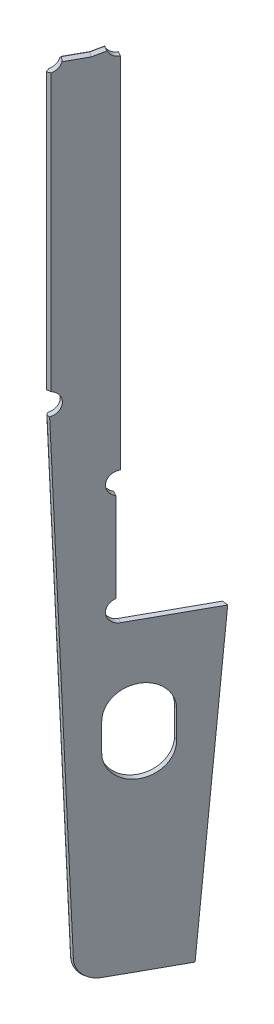
ISO-10303-21;
HEADER;
FILE_DESCRIPTION(('STEP AP214'),'2;1');
FILE_NAME('part.step','',(''),(''),'','','');
FILE_SCHEMA(('AUTOMOTIVE_DESIGN { 1 0 10303 214 1 1 1 1 }'));
ENDSEC;
DATA;
#1=APPLICATION_CONTEXT('core data for automotive mechanical design processes');
#2=APPLICATION_PROTOCOL_DEFINITION('international standard','automotive_design',2000,#1);
#3=PRODUCT_CONTEXT('',#1,'mechanical');
#4=PRODUCT('Part','Part','',(#3));
#5=PRODUCT_RELATED_PRODUCT_CATEGORY('part','',(#4));
#6=PRODUCT_DEFINITION_FORMATION('','',#4);
#7=PRODUCT_DEFINITION_CONTEXT('part definition',#1,'design');
#8=PRODUCT_DEFINITION('design','',#6,#7);
#9=PRODUCT_DEFINITION_SHAPE('','',#8);
#10=(LENGTH_UNIT() NAMED_UNIT(*) SI_UNIT(.MILLI.,.METRE.));
#11=(NAMED_UNIT(*) PLANE_ANGLE_UNIT() SI_UNIT($,.RADIAN.));
#12=(NAMED_UNIT(*) SI_UNIT($,.STERADIAN.) SOLID_ANGLE_UNIT());
#13=UNCERTAINTY_MEASURE_WITH_UNIT(LENGTH_MEASURE(1.E-05),#10,'distance_accuracy_value','');
#14=(GEOMETRIC_REPRESENTATION_CONTEXT(3) GLOBAL_UNCERTAINTY_ASSIGNED_CONTEXT((#13)) GLOBAL_UNIT_ASSIGNED_CONTEXT((#10,
#11,#12)) REPRESENTATION_CONTEXT('',''));
#15=CARTESIAN_POINT('',(0.,0.,0.));
#16=DIRECTION('',(0.,0.,1.));
#17=DIRECTION('',(1.,0.,0.));
#18=AXIS2_PLACEMENT_3D('',#15,#16,#17);
#19=CARTESIAN_POINT('',(498.305793985389,14720.,-981.474062663175));
#20=DIRECTION('',(0.874619707139395,0.,0.484809620246338));
#21=DIRECTION('',(0.484809620246338,0.,-0.874619707139395));
#22=AXIS2_PLACEMENT_3D('',#19,#20,#21);
#23=CYLINDRICAL_SURFACE('',#22,79.9999999999999);
#24=CARTESIAN_POINT('',(533.290582270965,14720.,-962.081677853322));
#25=DIRECTION('',(-0.874619707139395,0.,-0.484809620246338));
#26=DIRECTION('',(0.484809620246338,0.,-0.874619707139395));
#27=AXIS2_PLACEMENT_3D('',#24,#25,#26);
#28=CIRCLE('',#27,79.9999999999999);
#29=CARTESIAN_POINT('',(521.170341764806,14644.0065792321,-940.216185174837));
#30=VERTEX_POINT('',#29);
#31=CARTESIAN_POINT('',(533.290582270965,14800.,-962.081677853322));
#32=VERTEX_POINT('',#31);
#33=EDGE_CURVE('E270',#30,#32,#28,.T.);
#34=ORIENTED_EDGE('',*,*,#33,.F.);
#35=DIRECTION('',(0.874619707139395,0.,0.484809620246338));
#36=VECTOR('',#35,1.);
#37=CARTESIAN_POINT('',(486.18555347923,14644.0065792321,-959.60856998469));
#38=LINE('',#37,#36);
#39=CARTESIAN_POINT('',(486.18555347923,14644.0065792321,-959.60856998469));
#40=VERTEX_POINT('',#39);
#41=EDGE_CURVE('E319',#40,#30,#38,.T.);
#42=ORIENTED_EDGE('',*,*,#41,.F.);
#43=CARTESIAN_POINT('',(498.305793985389,14720.,-981.474062663175));
#44=DIRECTION('',(-0.874619707139395,0.,-0.484809620246338));
#45=DIRECTION('',(0.484809620246338,0.,-0.874619707139395));
#46=AXIS2_PLACEMENT_3D('',#43,#44,#45);
#47=CIRCLE('',#46,79.9999999999999);
#48=CARTESIAN_POINT('',(498.305793985389,14800.,-981.474062663175));
#49=VERTEX_POINT('',#48);
#50=EDGE_CURVE('E271',#40,#49,#47,.T.);
#51=ORIENTED_EDGE('',*,*,#50,.T.);
#52=DIRECTION('',(0.874619707139395,0.,0.484809620246338));
#53=VECTOR('',#52,1.);
#54=CARTESIAN_POINT('',(498.305793985389,14800.,-981.474062663175));
#55=LINE('',#54,#53);
#56=EDGE_CURVE('E294',#49,#32,#55,.T.);
#57=ORIENTED_EDGE('',*,*,#56,.T.);
#58=EDGE_LOOP('',(#34,#42,#51,#57));
#59=FACE_BOUND('',#58,.T.);
#60=ADVANCED_FACE('F35',(#59),#23,.F.);
#61=CARTESIAN_POINT('',(486.18555347923,14644.0065792321,-959.60856998469));
#62=DIRECTION('',(0.484809620246338,0.,-0.874619707139395));
#63=DIRECTION('',(-0.874619707139395,0.,-0.484809620246338));
#64=AXIS2_PLACEMENT_3D('',#61,#62,#63);
#65=PLANE('',#64);
#66=DIRECTION('',(0.,1.,0.));
#67=VECTOR('',#66,1.);
#68=CARTESIAN_POINT('',(521.170341764806,14644.0065792321,-940.216185174837));
#69=LINE('',#68,#67);
#70=CARTESIAN_POINT('',(521.170341764806,13995.9934207679,-940.216185174837));
#71=VERTEX_POINT('',#70);
#72=EDGE_CURVE('E275',#71,#30,#69,.T.);
#73=ORIENTED_EDGE('',*,*,#72,.F.);
#74=DIRECTION('',(0.874619707139395,0.,0.484809620246338));
#75=VECTOR('',#74,1.);
#76=CARTESIAN_POINT('',(486.18555347923,13995.9934207679,-959.60856998469));
#77=LINE('',#76,#75);
#78=CARTESIAN_POINT('',(486.18555347923,13995.9934207679,-959.60856998469));
#79=VERTEX_POINT('',#78);
#80=EDGE_CURVE('E322',#79,#71,#77,.T.);
#81=ORIENTED_EDGE('',*,*,#80,.F.);
#82=DIRECTION('',(0.,1.,0.));
#83=VECTOR('',#82,1.);
#84=CARTESIAN_POINT('',(486.18555347923,14644.0065792321,-959.60856998469));
#85=LINE('',#84,#83);
#86=EDGE_CURVE('E291',#79,#40,#85,.T.);
#87=ORIENTED_EDGE('',*,*,#86,.T.);
#88=ORIENTED_EDGE('',*,*,#41,.T.);
#89=EDGE_LOOP('',(#73,#81,#87,#88));
#90=FACE_BOUND('',#89,.T.);
#91=ADVANCED_FACE('F483',(#90),#65,.T.);
#92=CARTESIAN_POINT('',(498.305793985389,13920.,-981.474062663175));
#93=DIRECTION('',(0.874619707139395,0.,0.484809620246338));
#94=DIRECTION('',(0.484809620246338,0.,-0.874619707139395));
#95=AXIS2_PLACEMENT_3D('',#92,#93,#94);
#96=CYLINDRICAL_SURFACE('',#95,80.0000000000007);
#97=CARTESIAN_POINT('',(533.290582270964,13920.,-962.081677853322));
#98=DIRECTION('',(-0.874619707139395,0.,-0.484809620246338));
#99=DIRECTION('',(0.484809620246338,0.,-0.874619707139395));
#100=AXIS2_PLACEMENT_3D('',#97,#98,#99);
#101=CIRCLE('',#100,80.0000000000007);
#102=CARTESIAN_POINT('',(533.290582270964,13840.,-962.081677853322));
#103=VERTEX_POINT('',#102);
#104=EDGE_CURVE('E314',#103,#71,#101,.T.);
#105=ORIENTED_EDGE('',*,*,#104,.F.);
#106=DIRECTION('',(0.874619707139395,0.,0.484809620246338));
#107=VECTOR('',#106,1.);
#108=CARTESIAN_POINT('',(498.305793985389,13840.,-981.474062663175));
#109=LINE('',#108,#107);
#110=CARTESIAN_POINT('',(498.305793985389,13840.,-981.474062663175));
#111=VERTEX_POINT('',#110);
#112=EDGE_CURVE('E324',#111,#103,#109,.T.);
#113=ORIENTED_EDGE('',*,*,#112,.F.);
#114=CARTESIAN_POINT('',(498.305793985389,13920.,-981.474062663175));
#115=DIRECTION('',(-0.874619707139395,0.,-0.484809620246338));
#116=DIRECTION('',(0.484809620246338,0.,-0.874619707139395));
#117=AXIS2_PLACEMENT_3D('',#114,#115,#116);
#118=CIRCLE('',#117,80.0000000000007);
#119=EDGE_CURVE('E288',#111,#79,#118,.T.);
#120=ORIENTED_EDGE('',*,*,#119,.T.);
#121=ORIENTED_EDGE('',*,*,#80,.T.);
#122=EDGE_LOOP('',(#105,#113,#120,#121));
#123=FACE_BOUND('',#122,.T.);
#124=ADVANCED_FACE('F480',(#123),#96,.F.);
#125=CARTESIAN_POINT('',(498.305793985389,13840.,-981.474062663175));
#126=DIRECTION('',(0.,1.,0.));
#127=DIRECTION('',(0.,0.,1.));
#128=AXIS2_PLACEMENT_3D('',#125,#126,#127);
#129=PLANE('',#128);
#130=DIRECTION('',(0.874619707139395,0.,0.484809620246338));
#131=VECTOR('',#130,1.);
#132=CARTESIAN_POINT('',(775.853172698996,13840.,-1482.18278821293));
#133=LINE('',#132,#131);
#134=CARTESIAN_POINT('',(809.088721570294,13840.,-1463.76002264356));
#135=VERTEX_POINT('',#134);
#136=CARTESIAN_POINT('',(810.837960984572,13840.,-1462.79040340307));
#137=VERTEX_POINT('',#136);
#138=EDGE_CURVE('E326',#135,#137,#133,.T.);
#139=ORIENTED_EDGE('',*,*,#138,.F.);
#140=DIRECTION('',(-0.996294154677019,0.,-0.086011379226266));
#141=VECTOR('',#140,1.);
#142=CARTESIAN_POINT('',(541.933307255761,13840.,-1486.82389945654));
#143=LINE('',#142,#141);
#144=CARTESIAN_POINT('',(767.625459329421,13840.,-1467.33960037753));
#145=VERTEX_POINT('',#144);
#146=EDGE_CURVE('E450',#135,#145,#143,.T.);
#147=ORIENTED_EDGE('',*,*,#146,.T.);
#148=DIRECTION('',(-0.484809620246338,0.,0.874619707139395));
#149=VECTOR('',#148,1.);
#150=CARTESIAN_POINT('',(498.305793985389,13840.,-981.474062663175));
#151=LINE('',#150,#149);
#152=EDGE_CURVE('E286',#145,#111,#151,.T.);
#153=ORIENTED_EDGE('',*,*,#152,.T.);
#154=ORIENTED_EDGE('',*,*,#112,.T.);
#155=DIRECTION('',(-0.484809620246338,0.,0.874619707139395));
#156=VECTOR('',#155,1.);
#157=CARTESIAN_POINT('',(533.290582270964,13840.,-962.081677853322));
#158=LINE('',#157,#156);
#159=EDGE_CURVE('E311',#137,#103,#158,.T.);
#160=ORIENTED_EDGE('',*,*,#159,.F.);
#161=EDGE_LOOP('',(#139,#147,#153,#154,#160));
#162=FACE_BOUND('',#161,.T.);
#163=ADVANCED_FACE('F476',(#162),#129,.T.);
#164=CARTESIAN_POINT('',(691.137603838915,11620.,-1329.35185637435));
#165=DIRECTION('',(0.483314737994722,-0.0784689492798682,-0.871922868168972));
#166=DIRECTION('',(-0.874619707139395,0.,-0.484809620246338));
#167=AXIS2_PLACEMENT_3D('',#164,#165,#166);
#168=PLANE('',#167);
#169=DIRECTION('',(0.808354711930532,0.422384629598201,0.410065707391995));
#170=VECTOR('',#169,1.);
#171=CARTESIAN_POINT('',(694.128141253506,11611.9654240795,-1326.97110044609));
#172=LINE('',#171,#170);
#173=CARTESIAN_POINT('',(726.460485301051,11628.8598455049,-1310.56940780075));
#174=VERTEX_POINT('',#173);
#175=CARTESIAN_POINT('',(724.675657131345,11627.9272301886,-1311.4748232269));
#176=VERTEX_POINT('',#175);
#177=EDGE_CURVE('E379',#174,#176,#172,.F.);
#178=ORIENTED_EDGE('',*,*,#177,.T.);
#179=DIRECTION('',(0.0380425015015021,0.996916558192768,-0.0686304894386944));
#180=VECTOR('',#179,1.);
#181=CARTESIAN_POINT('',(809.088721570294,13840.,-1463.76002264356));
#182=LINE('',#181,#180);
#183=EDGE_CURVE('E444',#176,#135,#182,.T.);
#184=ORIENTED_EDGE('',*,*,#183,.T.);
#185=ORIENTED_EDGE('',*,*,#138,.T.);
#186=DIRECTION('',(0.0380425015015021,0.996916558192767,-0.0686304894386944));
#187=VECTOR('',#186,1.);
#188=CARTESIAN_POINT('',(726.122392124491,11620.,-1309.9594715645));
#189=LINE('',#188,#187);
#190=EDGE_CURVE('E308',#174,#137,#189,.T.);
#191=ORIENTED_EDGE('',*,*,#190,.F.);
#192=EDGE_LOOP('',(#178,#184,#185,#191));
#193=FACE_BOUND('',#192,.T.);
#194=ADVANCED_FACE('F472',(#193),#168,.T.);
#195=CARTESIAN_POINT('',(449.662502831305,11620.,-893.719242447636));
#196=DIRECTION('',(0.,-1.,0.));
#197=DIRECTION('',(0.,0.,-1.));
#198=AXIS2_PLACEMENT_3D('',#195,#196,#197);
#199=PLANE('',#198);
#200=DIRECTION('',(0.484809620246338,0.,-0.874619707139395));
#201=VECTOR('',#200,1.);
#202=CARTESIAN_POINT('',(707.755378274562,11620.,-1320.14047358967));
#203=LINE('',#202,#201);
#204=CARTESIAN_POINT('',(466.280277266952,11620.,-884.507859662957));
#205=VERTEX_POINT('',#204);
#206=CARTESIAN_POINT('',(703.641521589773,11620.,-1312.71887967197));
#207=VERTEX_POINT('',#206);
#208=EDGE_CURVE('E377',#205,#207,#203,.T.);
#209=ORIENTED_EDGE('',*,*,#208,.T.);
#210=DIRECTION('',(0.996294154677019,0.,0.0860113792262664));
#211=VECTOR('',#210,1.);
#212=CARTESIAN_POINT('',(487.446611490652,11620.,-1331.38326941272));
#213=LINE('',#212,#211);
#214=CARTESIAN_POINT('',(705.823798549822,11620.,-1312.53048084387));
#215=VERTEX_POINT('',#214);
#216=EDGE_CURVE('E43',#207,#215,#213,.T.);
#217=ORIENTED_EDGE('',*,*,#216,.T.);
#218=DIRECTION('',(-0.484809620246338,0.,0.874619707139395));
#219=VECTOR('',#218,1.);
#220=CARTESIAN_POINT('',(468.029516681233,11620.,-883.538240422463));
#221=LINE('',#220,#219);
#222=CARTESIAN_POINT('',(468.029516681233,11620.,-883.538240422463));
#223=VERTEX_POINT('',#222);
#224=EDGE_CURVE('E375',#215,#223,#221,.T.);
#225=ORIENTED_EDGE('',*,*,#224,.T.);
#226=DIRECTION('',(0.874619707139395,0.,0.484809620246338));
#227=VECTOR('',#226,1.);
#228=CARTESIAN_POINT('',(449.662502831305,11620.,-893.719242447636));
#229=LINE('',#228,#227);
#230=EDGE_CURVE('E328',#205,#223,#229,.T.);
#231=ORIENTED_EDGE('',*,*,#230,.F.);
#232=EDGE_LOOP('',(#209,#217,#225,#231));
#233=FACE_BOUND('',#232,.T.);
#234=ADVANCED_FACE('F573',(#233),#199,.T.);
#235=CARTESIAN_POINT('',(449.662502831305,11780.0052258575,-893.719242447636));
#236=DIRECTION('',(0.874619707139395,0.,0.484809620246338));
#237=DIRECTION('',(0.484809620246338,0.,-0.874619707139395));
#238=AXIS2_PLACEMENT_3D('',#235,#236,#237);
#239=CYLINDRICAL_SURFACE('',#238,160.005225857454);
#240=DIRECTION('',(0.874619707139395,0.,0.484809620246338));
#241=VECTOR('',#240,1.);
#242=CARTESIAN_POINT('',(372.14330392935,11774.0985511503,-753.870905678126));
#243=LINE('',#242,#241);
#244=CARTESIAN_POINT('',(388.761078364997,11774.0985511503,-744.659522893446));
#245=VERTEX_POINT('',#244);
#246=CARTESIAN_POINT('',(390.510317779278,11774.0985511503,-743.689903652953));
#247=VERTEX_POINT('',#246);
#248=EDGE_CURVE('E331',#245,#247,#243,.T.);
#249=ORIENTED_EDGE('',*,*,#248,.F.);
#250=CARTESIAN_POINT('',(466.280277266952,11780.0052258575,-884.507859662957));
#251=DIRECTION('',(0.874619707139396,0.,0.484809620246337));
#252=DIRECTION('',(0.484809620246337,0.,-0.874619707139396));
#253=AXIS2_PLACEMENT_3D('',#250,#251,#252);
#254=CIRCLE('',#253,160.005225857454);
#255=EDGE_CURVE('E373',#245,#205,#254,.T.);
#256=ORIENTED_EDGE('',*,*,#255,.T.);
#257=ORIENTED_EDGE('',*,*,#230,.T.);
#258=CARTESIAN_POINT('',(468.029516681233,11780.0052258575,-883.538240422463));
#259=DIRECTION('',(0.874619707139396,0.,0.484809620246337));
#260=DIRECTION('',(0.484809620246337,0.,-0.874619707139396));
#261=AXIS2_PLACEMENT_3D('',#258,#259,#260);
#262=CIRCLE('',#261,160.005225857454);
#263=EDGE_CURVE('E371',#223,#247,#262,.F.);
#264=ORIENTED_EDGE('',*,*,#263,.T.);
#265=EDGE_LOOP('',(#249,#256,#257,#264));
#266=FACE_BOUND('',#265,.T.);
#267=ADVANCED_FACE('F560',(#266),#239,.T.);
#268=CARTESIAN_POINT('',(372.14330392935,11774.0985511503,-753.870905678125));
#269=DIRECTION('',(-0.48447916926798,-0.0369155111994877,0.874023557793661));
#270=DIRECTION('',(0.874619707139395,0.,0.484809620246338));
#271=AXIS2_PLACEMENT_3D('',#268,#269,#270);
#272=PLANE('',#271);
#273=DIRECTION('',(0.874619707139395,0.,0.484809620246338));
#274=VECTOR('',#273,1.);
#275=CARTESIAN_POINT('',(310.66180168659,15207.0545287824,-642.95533956636));
#276=LINE('',#275,#274);
#277=CARTESIAN_POINT('',(327.279576122237,15207.0545287824,-633.74395678168));
#278=VERTEX_POINT('',#277);
#279=CARTESIAN_POINT('',(329.028815536518,15207.0545287824,-632.774337541187));
#280=VERTEX_POINT('',#279);
#281=EDGE_CURVE('E334',#278,#280,#276,.T.);
#282=ORIENTED_EDGE('',*,*,#281,.F.);
#283=DIRECTION('',(0.0178969949658231,-0.999318390220495,-0.032287033594197));
#284=VECTOR('',#283,1.);
#285=CARTESIAN_POINT('',(388.761078364997,11774.0985511503,-744.659522893446));
#286=LINE('',#285,#284);
#287=EDGE_CURVE('E356',#278,#245,#286,.T.);
#288=ORIENTED_EDGE('',*,*,#287,.T.);
#289=ORIENTED_EDGE('',*,*,#248,.T.);
#290=DIRECTION('',(-0.0178969949658231,0.999318390220495,0.032287033594197));
#291=VECTOR('',#290,1.);
#292=CARTESIAN_POINT('',(390.510317779277,11774.0985511503,-743.689903652952));
#293=LINE('',#292,#291);
#294=EDGE_CURVE('E321',#247,#280,#293,.T.);
#295=ORIENTED_EDGE('',*,*,#294,.T.);
#296=EDGE_LOOP('',(#282,#288,#289,#295));
#297=FACE_BOUND('',#296,.T.);
#298=ADVANCED_FACE('F563',(#297),#272,.T.);
#299=CARTESIAN_POINT('',(309.230042089324,15287.,-640.372376878824));
#300=DIRECTION('',(0.874619707139395,0.,0.484809620246338));
#301=DIRECTION('',(0.484809620246338,0.,-0.874619707139395));
#302=AXIS2_PLACEMENT_3D('',#299,#300,#301);
#303=CYLINDRICAL_SURFACE('',#302,80.);
#304=DIRECTION('',(0.874619707139395,0.,0.484809620246338));
#305=VECTOR('',#304,1.);
#306=CARTESIAN_POINT('',(309.230042089324,15367.,-640.372376878824));
#307=LINE('',#306,#305);
#308=CARTESIAN_POINT('',(325.847816524972,15367.,-631.160994094144));
#309=VERTEX_POINT('',#308);
#310=CARTESIAN_POINT('',(327.59705593925,15367.,-630.191374853652));
#311=VERTEX_POINT('',#310);
#312=EDGE_CURVE('E337',#309,#311,#307,.T.);
#313=ORIENTED_EDGE('',*,*,#312,.F.);
#314=CARTESIAN_POINT('',(325.847816524972,15287.,-631.160994094144));
#315=DIRECTION('',(-0.96126169593832,0.,0.275637355816995));
#316=DIRECTION('',(0.275637355816995,0.,0.96126169593832));
#317=AXIS2_PLACEMENT_3D('',#314,#315,#316);
#318=ELLIPSE('',#317,113.137084989847,80.);
#319=CARTESIAN_POINT('',(318.441424874004,15364.7110030819,-656.990151314472));
#320=VERTEX_POINT('',#319);
#321=EDGE_CURVE('E442',#309,#320,#318,.T.);
#322=ORIENTED_EDGE('',*,*,#321,.T.);
#323=CARTESIAN_POINT('',(309.230042089324,15287.,-640.372376878824));
#324=DIRECTION('',(-0.874619707139395,0.,-0.484809620246338));
#325=DIRECTION('',(0.484809620246338,0.,-0.874619707139395));
#326=AXIS2_PLACEMENT_3D('',#323,#324,#325);
#327=CIRCLE('',#326,80.);
#328=CARTESIAN_POINT('',(314.94540482501,15207.8733780971,-650.683164192701));
#329=VERTEX_POINT('',#328);
#330=EDGE_CURVE('E284',#320,#329,#327,.T.);
#331=ORIENTED_EDGE('',*,*,#330,.T.);
#332=CARTESIAN_POINT('',(325.847816524971,15287.,-631.160994094145));
#333=DIRECTION('',(-0.808717504080015,-0.0334568152625347,0.587244957498214));
#334=DIRECTION('',(0.587924906910554,-0.0156011691743961,0.808765050774703));
#335=AXIS2_PLACEMENT_3D('',#332,#333,#334);
#336=ELLIPSE('',#335,189.296126652209,80.);
#337=EDGE_CURVE('E369',#329,#278,#336,.T.);
#338=ORIENTED_EDGE('',*,*,#337,.T.);
#339=ORIENTED_EDGE('',*,*,#281,.T.);
#340=CARTESIAN_POINT('',(327.597055939252,15287.,-630.191374853651));
#341=DIRECTION('',(0.0694569834491823,0.033456815262534,-0.99702375546555));
#342=DIRECTION('',(0.997424395641762,0.0156011691743976,0.0700084173443344));
#343=AXIS2_PLACEMENT_3D('',#340,#341,#342);
#344=ELLIPSE('',#343,189.29612665219,80.);
#345=CARTESIAN_POINT('',(349.930193110587,15207.8733780971,-631.290779382849));
#346=VERTEX_POINT('',#345);
#347=EDGE_CURVE('E366',#280,#346,#344,.F.);
#348=ORIENTED_EDGE('',*,*,#347,.T.);
#349=CARTESIAN_POINT('',(344.2148303749,15287.,-620.979992068971));
#350=DIRECTION('',(-0.874619707139395,0.,-0.484809620246338));
#351=DIRECTION('',(0.484809620246338,0.,-0.874619707139395));
#352=AXIS2_PLACEMENT_3D('',#349,#350,#351);
#353=CIRCLE('',#352,80.);
#354=CARTESIAN_POINT('',(353.426213159581,15364.7110030819,-637.59776650462));
#355=VERTEX_POINT('',#354);
#356=EDGE_CURVE('E306',#355,#346,#353,.T.);
#357=ORIENTED_EDGE('',*,*,#356,.F.);
#358=CARTESIAN_POINT('',(327.59705593925,15287.,-630.191374853652));
#359=DIRECTION('',(-0.275637355817004,0.,-0.961261695938318));
#360=DIRECTION('',(0.961261695938318,0.,-0.275637355817004));
#361=AXIS2_PLACEMENT_3D('',#358,#359,#360);
#362=ELLIPSE('',#361,113.137084989847,80.);
#363=EDGE_CURVE('E440',#355,#311,#362,.F.);
#364=ORIENTED_EDGE('',*,*,#363,.T.);
#365=EDGE_LOOP('',(#313,#322,#331,#338,#339,#348,#357,#364));
#366=FACE_BOUND('',#365,.T.);
#367=ADVANCED_FACE('F546',(#366),#303,.F.);
#368=CARTESIAN_POINT('',(309.230042089324,15367.,-640.372376878824));
#369=DIRECTION('',(-0.484809620246338,0.,0.874619707139395));
#370=DIRECTION('',(0.874619707139395,0.,0.484809620246338));
#371=AXIS2_PLACEMENT_3D('',#368,#369,#370);
#372=PLANE('',#371);
#373=DIRECTION('',(0.874619707139395,0.,0.484809620246338));
#374=VECTOR('',#373,1.);
#375=CARTESIAN_POINT('',(309.230042089324,17366.,-640.372376878824));
#376=LINE('',#375,#374);
#377=CARTESIAN_POINT('',(325.847816524972,17366.,-631.160994094144));
#378=VERTEX_POINT('',#377);
#379=CARTESIAN_POINT('',(327.59705593925,17366.,-630.191374853652));
#380=VERTEX_POINT('',#379);
#381=EDGE_CURVE('E340',#378,#380,#376,.T.);
#382=ORIENTED_EDGE('',*,*,#381,.F.);
#383=DIRECTION('',(0.,-1.,0.));
#384=VECTOR('',#383,1.);
#385=CARTESIAN_POINT('',(325.847816524972,15367.,-631.160994094144));
#386=LINE('',#385,#384);
#387=EDGE_CURVE('E437',#378,#309,#386,.T.);
#388=ORIENTED_EDGE('',*,*,#387,.T.);
#389=ORIENTED_EDGE('',*,*,#312,.T.);
#390=DIRECTION('',(0.,1.,0.));
#391=VECTOR('',#390,1.);
#392=CARTESIAN_POINT('',(327.59705593925,15367.,-630.191374853652));
#393=LINE('',#392,#391);
#394=EDGE_CURVE('E435',#311,#380,#393,.T.);
#395=ORIENTED_EDGE('',*,*,#394,.T.);
#396=EDGE_LOOP('',(#382,#388,#389,#395));
#397=FACE_BOUND('',#396,.T.);
#398=ADVANCED_FACE('F539',(#397),#372,.T.);
#399=CARTESIAN_POINT('',(309.230042089324,17446.,-640.372376878824));
#400=DIRECTION('',(0.874619707139395,0.,0.484809620246338));
#401=DIRECTION('',(0.484809620246338,0.,-0.874619707139395));
#402=AXIS2_PLACEMENT_3D('',#399,#400,#401);
#403=CYLINDRICAL_SURFACE('',#402,79.9999999999992);
#404=DIRECTION('',(0.874619707139395,0.,0.484809620246338));
#405=VECTOR('',#404,1.);
#406=CARTESIAN_POINT('',(348.014811709031,17446.,-710.341953449975));
#407=LINE('',#406,#405);
#408=CARTESIAN_POINT('',(364.632586144676,17446.,-701.130570665296));
#409=VERTEX_POINT('',#408);
#410=CARTESIAN_POINT('',(366.381825558959,17446.,-700.160951424802));
#411=VERTEX_POINT('',#410);
#412=EDGE_CURVE('E343',#409,#411,#407,.T.);
#413=ORIENTED_EDGE('',*,*,#412,.F.);
#414=CARTESIAN_POINT('',(325.847816524965,17446.,-631.160994094148));
#415=DIRECTION('',(-0.618449525877682,0.707106781186512,-0.342812170060693));
#416=DIRECTION('',(0.618449525877635,0.707106781186584,0.342812170060629));
#417=AXIS2_PLACEMENT_3D('',#414,#415,#416);
#418=ELLIPSE('',#417,113.137084989841,79.9999999999992);
#419=CARTESIAN_POINT('',(346.905083982438,17427.,-708.339951635852));
#420=VERTEX_POINT('',#419);
#421=EDGE_CURVE('E425',#409,#420,#418,.T.);
#422=ORIENTED_EDGE('',*,*,#421,.T.);
#423=CARTESIAN_POINT('',(309.230042089324,17446.,-640.372376878824));
#424=DIRECTION('',(-0.874619707139395,0.,-0.484809620246338));
#425=DIRECTION('',(0.484809620246338,0.,-0.874619707139395));
#426=AXIS2_PLACEMENT_3D('',#423,#424,#425);
#427=CIRCLE('',#426,79.9999999999992);
#428=CARTESIAN_POINT('',(318.441424874004,17368.2889969181,-656.990151314472));
#429=VERTEX_POINT('',#428);
#430=EDGE_CURVE('E281',#420,#429,#427,.T.);
#431=ORIENTED_EDGE('',*,*,#430,.T.);
#432=CARTESIAN_POINT('',(325.847816524972,17446.,-631.160994094144));
#433=DIRECTION('',(-0.96126169593832,0.,0.275637355816995));
#434=DIRECTION('',(0.275637355816995,0.,0.96126169593832));
#435=AXIS2_PLACEMENT_3D('',#432,#433,#434);
#436=ELLIPSE('',#435,113.137084989846,79.9999999999992);
#437=EDGE_CURVE('E421',#429,#378,#436,.T.);
#438=ORIENTED_EDGE('',*,*,#437,.T.);
#439=ORIENTED_EDGE('',*,*,#381,.T.);
#440=CARTESIAN_POINT('',(327.59705593925,17446.,-630.191374853652));
#441=DIRECTION('',(-0.275637355817004,0.,-0.961261695938318));
#442=DIRECTION('',(0.961261695938318,0.,-0.275637355817004));
#443=AXIS2_PLACEMENT_3D('',#440,#441,#442);
#444=ELLIPSE('',#443,113.137084989846,79.9999999999992);
#445=CARTESIAN_POINT('',(353.426213159581,17368.2889969181,-637.59776650462));
#446=VERTEX_POINT('',#445);
#447=EDGE_CURVE('E419',#380,#446,#444,.F.);
#448=ORIENTED_EDGE('',*,*,#447,.T.);
#449=CARTESIAN_POINT('',(344.2148303749,17446.,-620.979992068971));
#450=DIRECTION('',(-0.874619707139395,0.,-0.484809620246338));
#451=DIRECTION('',(0.484809620246338,0.,-0.874619707139395));
#452=AXIS2_PLACEMENT_3D('',#449,#450,#451);
#453=CIRCLE('',#452,79.9999999999992);
#454=CARTESIAN_POINT('',(381.889872268014,17427.,-688.947566825999));
#455=VERTEX_POINT('',#454);
#456=EDGE_CURVE('E303',#455,#446,#453,.T.);
#457=ORIENTED_EDGE('',*,*,#456,.F.);
#458=CARTESIAN_POINT('',(327.597055939257,17446.,-630.191374853648));
#459=DIRECTION('',(-0.618449525877647,-0.70710678118657,-0.342812170060635));
#460=DIRECTION('',(0.61844952587767,-0.707106781186525,0.342812170060686));
#461=AXIS2_PLACEMENT_3D('',#458,#459,#460);
#462=ELLIPSE('',#461,113.13708498985,79.9999999999992);
#463=EDGE_CURVE('E423',#455,#411,#462,.F.);
#464=ORIENTED_EDGE('',*,*,#463,.T.);
#465=EDGE_LOOP('',(#413,#422,#431,#438,#439,#448,#457,#464));
#466=FACE_BOUND('',#465,.T.);
#467=ADVANCED_FACE('F510',(#466),#403,.F.);
#468=CARTESIAN_POINT('',(348.014811709031,17446.,-710.341953449976));
#469=DIRECTION('',(0.,1.,0.));
#470=DIRECTION('',(0.,0.,1.));
#471=AXIS2_PLACEMENT_3D('',#468,#469,#470);
#472=PLANE('',#471);
#473=DIRECTION('',(0.874619707139395,0.,0.484809620246338));
#474=VECTOR('',#473,1.);
#475=CARTESIAN_POINT('',(421.622525301415,17446.,-843.133783926977));
#476=LINE('',#475,#474);
#477=CARTESIAN_POINT('',(438.24029973706,17446.,-833.922401142298));
#478=VERTEX_POINT('',#477);
#479=CARTESIAN_POINT('',(439.989539151343,17446.,-832.952781901803));
#480=VERTEX_POINT('',#479);
#481=EDGE_CURVE('E346',#478,#480,#476,.T.);
#482=ORIENTED_EDGE('',*,*,#481,.F.);
#483=DIRECTION('',(-0.484809620246338,0.,0.874619707139395));
#484=VECTOR('',#483,1.);
#485=CARTESIAN_POINT('',(364.632586144676,17446.,-701.130570665296));
#486=LINE('',#485,#484);
#487=EDGE_CURVE('E417',#478,#409,#486,.T.);
#488=ORIENTED_EDGE('',*,*,#487,.T.);
#489=ORIENTED_EDGE('',*,*,#412,.T.);
#490=DIRECTION('',(0.484809620246338,0.,-0.874619707139395));
#491=VECTOR('',#490,1.);
#492=CARTESIAN_POINT('',(366.381825558959,17446.,-700.160951424802));
#493=LINE('',#492,#491);
#494=EDGE_CURVE('E415',#411,#480,#493,.T.);
#495=ORIENTED_EDGE('',*,*,#494,.T.);
#496=EDGE_LOOP('',(#482,#488,#489,#495));
#497=FACE_BOUND('',#496,.T.);
#498=ADVANCED_FACE('F516',(#497),#472,.T.);
#499=CARTESIAN_POINT('',(421.622525301415,17446.,-843.133783926977));
#500=DIRECTION('',(-0.117583604270062,0.970142500145337,0.212126437340129));
#501=DIRECTION('',(0.,-0.213608240496687,0.976919402812693));
#502=AXIS2_PLACEMENT_3D('',#499,#500,#501);
#503=PLANE('',#502);
#504=DIRECTION('',(0.874619707139395,0.,0.484809620246338));
#505=VECTOR('',#504,1.);
#506=CARTESIAN_POINT('',(460.309628055004,17465.9496364851,-912.927164807543));
#507=LINE('',#506,#505);
#508=CARTESIAN_POINT('',(476.927402490649,17465.9496364851,-903.715782022865));
#509=VERTEX_POINT('',#508);
#510=CARTESIAN_POINT('',(478.676641904931,17465.9496364851,-902.74616278237));
#511=VERTEX_POINT('',#510);
#512=EDGE_CURVE('E349',#509,#511,#507,.T.);
#513=ORIENTED_EDGE('',*,*,#512,.F.);
#514=DIRECTION('',(-0.470334417080294,-0.242535625036311,0.848505749360596));
#515=VECTOR('',#514,1.);
#516=CARTESIAN_POINT('',(438.24029973706,17446.,-833.922401142298));
#517=LINE('',#516,#515);
#518=EDGE_CURVE('E402',#509,#478,#517,.T.);
#519=ORIENTED_EDGE('',*,*,#518,.T.);
#520=ORIENTED_EDGE('',*,*,#481,.T.);
#521=DIRECTION('',(0.470334417080294,0.242535625036311,-0.848505749360596));
#522=VECTOR('',#521,1.);
#523=CARTESIAN_POINT('',(439.989539151342,17446.,-832.952781901803));
#524=LINE('',#523,#522);
#525=EDGE_CURVE('E389',#480,#511,#524,.T.);
#526=ORIENTED_EDGE('',*,*,#525,.T.);
#527=EDGE_LOOP('',(#513,#519,#520,#526));
#528=FACE_BOUND('',#527,.T.);
#529=ADVANCED_FACE('F518',(#528),#503,.T.);
#530=CARTESIAN_POINT('',(498.305793985389,17482.,-981.474062663175));
#531=DIRECTION('',(0.874619707139395,0.,0.484809620246338));
#532=DIRECTION('',(0.484809620246338,0.,-0.874619707139395));
#533=AXIS2_PLACEMENT_3D('',#530,#531,#532);
#534=CYLINDRICAL_SURFACE('',#533,79.9999999999989);
#535=CARTESIAN_POINT('',(498.305793985389,17482.,-981.474062663175));
#536=DIRECTION('',(-0.874619707139395,0.,-0.484809620246338));
#537=DIRECTION('',(0.484809620246338,0.,-0.874619707139395));
#538=AXIS2_PLACEMENT_3D('',#535,#536,#537);
#539=CIRCLE('',#538,79.9999999999989);
#540=CARTESIAN_POINT('',(498.305793985389,17402.,-981.474062663175));
#541=VERTEX_POINT('',#540);
#542=CARTESIAN_POINT('',(463.227809064067,17447.869692469,-918.19170270642));
#543=VERTEX_POINT('',#542);
#544=EDGE_CURVE('E278',#541,#543,#539,.T.);
#545=ORIENTED_EDGE('',*,*,#544,.T.);
#546=CARTESIAN_POINT('',(511.917329427032,17482.,-973.929065363702));
#547=DIRECTION('',(-0.701593689813395,0.685994340570013,-0.192816127748531));
#548=DIRECTION('',(0.535305361941916,0.685994340570066,0.492808212372801));
#549=AXIS2_PLACEMENT_3D('',#546,#547,#548);
#550=ELLIPSE('',#549,113.137084989842,79.9999999999989);
#551=EDGE_CURVE('E413',#543,#509,#550,.T.);
#552=ORIENTED_EDGE('',*,*,#551,.T.);
#553=ORIENTED_EDGE('',*,*,#512,.T.);
#554=CARTESIAN_POINT('',(519.679046829318,17482.,-969.626675152796));
#555=DIRECTION('',(-0.535305361941982,-0.68599434057,-0.492808212372819));
#556=DIRECTION('',(0.701593689813345,-0.685994340570078,0.192816127748485));
#557=AXIS2_PLACEMENT_3D('',#554,#555,#556);
#558=ELLIPSE('',#557,113.13708498984,79.9999999999989);
#559=CARTESIAN_POINT('',(498.212597349643,17447.869692469,-898.799317896568));
#560=VERTEX_POINT('',#559);
#561=EDGE_CURVE('E411',#511,#560,#558,.F.);
#562=ORIENTED_EDGE('',*,*,#561,.T.);
#563=CARTESIAN_POINT('',(533.290582270964,17482.,-962.081677853321));
#564=DIRECTION('',(-0.874619707139395,0.,-0.484809620246338));
#565=DIRECTION('',(0.484809620246338,0.,-0.874619707139395));
#566=AXIS2_PLACEMENT_3D('',#563,#564,#565);
#567=CIRCLE('',#566,79.9999999999989);
#568=CARTESIAN_POINT('',(533.290582270964,17402.,-962.081677853321));
#569=VERTEX_POINT('',#568);
#570=EDGE_CURVE('E300',#569,#560,#567,.T.);
#571=ORIENTED_EDGE('',*,*,#570,.F.);
#572=DIRECTION('',(0.874619707139395,0.,0.484809620246338));
#573=VECTOR('',#572,1.);
#574=CARTESIAN_POINT('',(498.305793985389,17402.,-981.474062663175));
#575=LINE('',#574,#573);
#576=EDGE_CURVE('E352',#541,#569,#575,.T.);
#577=ORIENTED_EDGE('',*,*,#576,.F.);
#578=EDGE_LOOP('',(#545,#552,#553,#562,#571,#577));
#579=FACE_BOUND('',#578,.T.);
#580=ADVANCED_FACE('F496',(#579),#534,.F.);
#581=CARTESIAN_POINT('',(498.305793985389,17402.,-981.474062663175));
#582=DIRECTION('',(0.484809620246338,0.,-0.874619707139395));
#583=DIRECTION('',(-0.874619707139395,0.,-0.484809620246338));
#584=AXIS2_PLACEMENT_3D('',#581,#582,#583);
#585=PLANE('',#584);
#586=DIRECTION('',(0.,1.,0.));
#587=VECTOR('',#586,1.);
#588=CARTESIAN_POINT('',(533.290582270964,17402.,-962.081677853321));
#589=LINE('',#588,#587);
#590=EDGE_CURVE('E297',#32,#569,#589,.T.);
#591=ORIENTED_EDGE('',*,*,#590,.F.);
#592=ORIENTED_EDGE('',*,*,#56,.F.);
#593=DIRECTION('',(0.,1.,0.));
#594=VECTOR('',#593,1.);
#595=CARTESIAN_POINT('',(498.305793985389,17402.,-981.474062663175));
#596=LINE('',#595,#594);
#597=EDGE_CURVE('E274',#49,#541,#596,.T.);
#598=ORIENTED_EDGE('',*,*,#597,.T.);
#599=ORIENTED_EDGE('',*,*,#576,.T.);
#600=EDGE_LOOP('',(#591,#592,#598,#599));
#601=FACE_BOUND('',#600,.T.);
#602=ADVANCED_FACE('F492',(#601),#585,.T.);
#603=CARTESIAN_POINT('',(498.305793985389,14720.,-981.474062663175));
#604=DIRECTION('',(0.874619707139395,0.,0.484809620246338));
#605=DIRECTION('',(0.484809620246338,0.,-0.874619707139395));
#606=AXIS2_PLACEMENT_3D('',#603,#604,#605);
#607=PLANE('',#606);
#608=DIRECTION('',(0.,-1.,0.));
#609=VECTOR('',#608,1.);
#610=CARTESIAN_POINT('',(449.824831960762,14720.,-894.012091949249));
#611=LINE('',#610,#609);
#612=CARTESIAN_POINT('',(449.824831960762,13240.,-894.012091949249));
#613=VERTEX_POINT('',#612);
#614=CARTESIAN_POINT('',(449.824831960762,13040.,-894.012091949249));
#615=VERTEX_POINT('',#614);
#616=EDGE_CURVE('E264',#613,#615,#611,.T.);
#617=ORIENTED_EDGE('',*,*,#616,.T.);
#618=CARTESIAN_POINT('',(546.78675601003,13040.,-1068.93603337713));
#619=DIRECTION('',(0.874619707139395,0.,0.484809620246338));
#620=DIRECTION('',(0.484809620246338,0.,-0.874619707139395));
#621=AXIS2_PLACEMENT_3D('',#618,#619,#620);
#622=CIRCLE('',#621,200.);
#623=CARTESIAN_POINT('',(643.748680059297,13040.,-1243.85997480501));
#624=VERTEX_POINT('',#623);
#625=EDGE_CURVE('E267',#615,#624,#622,.T.);
#626=ORIENTED_EDGE('',*,*,#625,.T.);
#627=DIRECTION('',(0.,1.,0.));
#628=VECTOR('',#627,1.);
#629=CARTESIAN_POINT('',(643.748680059297,14720.,-1243.85997480501));
#630=LINE('',#629,#628);
#631=CARTESIAN_POINT('',(643.748680059297,13240.,-1243.85997480501));
#632=VERTEX_POINT('',#631);
#633=EDGE_CURVE('E259',#624,#632,#630,.T.);
#634=ORIENTED_EDGE('',*,*,#633,.T.);
#635=CARTESIAN_POINT('',(546.78675601003,13240.,-1068.93603337713));
#636=DIRECTION('',(0.874619707139395,0.,0.484809620246338));
#637=DIRECTION('',(0.484809620246338,0.,-0.874619707139395));
#638=AXIS2_PLACEMENT_3D('',#635,#636,#637);
#639=CIRCLE('',#638,200.);
#640=EDGE_CURVE('E234',#632,#613,#639,.T.);
#641=ORIENTED_EDGE('',*,*,#640,.T.);
#642=EDGE_LOOP('',(#617,#626,#634,#641));
#643=FACE_BOUND('',#642,.T.);
#644=ORIENTED_EDGE('',*,*,#152,.F.);
#645=DIRECTION('',(-0.0380425015015021,-0.996916558192767,0.0686304894386944));
#646=VECTOR('',#645,1.);
#647=CARTESIAN_POINT('',(683.298644770745,11630.1874373357,-1315.20999986376));
#648=LINE('',#647,#646);
#649=CARTESIAN_POINT('',(683.2479836459,11628.8598455049,-1315.1186047752));
#650=VERTEX_POINT('',#649);
#651=EDGE_CURVE('E452',#145,#650,#648,.T.);
#652=ORIENTED_EDGE('',*,*,#651,.T.);
#653=DIRECTION('',(-0.484809620246338,0.,0.874619707139395));
#654=VECTOR('',#653,1.);
#655=CARTESIAN_POINT('',(449.662502831305,11628.8598455049,-893.719242447636));
#656=LINE('',#655,#654);
#657=CARTESIAN_POINT('',(449.662502831305,11628.8598455049,-893.719242447636));
#658=VERTEX_POINT('',#657);
#659=EDGE_CURVE('E359',#650,#658,#656,.T.);
#660=ORIENTED_EDGE('',*,*,#659,.T.);
#661=CARTESIAN_POINT('',(449.662502831305,11780.0052258575,-893.719242447636));
#662=DIRECTION('',(0.874619707139395,0.,0.484809620246338));
#663=DIRECTION('',(0.484809620246338,0.,-0.874619707139395));
#664=AXIS2_PLACEMENT_3D('',#661,#662,#663);
#665=CIRCLE('',#664,151.14538035251);
#666=CARTESIAN_POINT('',(376.435714519428,11774.4256168763,-761.614619367859));
#667=VERTEX_POINT('',#666);
#668=EDGE_CURVE('E361',#658,#667,#665,.F.);
#669=ORIENTED_EDGE('',*,*,#668,.T.);
#670=DIRECTION('',(-0.0178969949658231,0.999318390220495,0.032287033594197));
#671=VECTOR('',#670,1.);
#672=CARTESIAN_POINT('',(314.954212276668,15207.3815945083,-650.699053256093));
#673=LINE('',#672,#671);
#674=EDGE_CURVE('E363',#667,#329,#673,.T.);
#675=ORIENTED_EDGE('',*,*,#674,.T.);
#676=ORIENTED_EDGE('',*,*,#330,.F.);
#677=DIRECTION('',(0.,1.,0.));
#678=VECTOR('',#677,1.);
#679=CARTESIAN_POINT('',(318.441424874004,17366.,-656.990151314472));
#680=LINE('',#679,#678);
#681=EDGE_CURVE('E405',#320,#429,#680,.T.);
#682=ORIENTED_EDGE('',*,*,#681,.T.);
#683=ORIENTED_EDGE('',*,*,#430,.F.);
#684=DIRECTION('',(0.484809620246338,0.,-0.874619707139395));
#685=VECTOR('',#684,1.);
#686=CARTESIAN_POINT('',(421.622525301414,17427.,-843.133783926976));
#687=LINE('',#686,#685);
#688=CARTESIAN_POINT('',(422.756498341922,17427.,-845.179525445242));
#689=VERTEX_POINT('',#688);
#690=EDGE_CURVE('E407',#420,#689,#687,.T.);
#691=ORIENTED_EDGE('',*,*,#690,.T.);
#692=DIRECTION('',(0.470334417080294,0.242535625036311,-0.848505749360596));
#693=VECTOR('',#692,1.);
#694=CARTESIAN_POINT('',(462.543716536134,17447.5169289823,-916.957567117005));
#695=LINE('',#694,#693);
#696=EDGE_CURVE('E409',#689,#543,#695,.T.);
#697=ORIENTED_EDGE('',*,*,#696,.T.);
#698=ORIENTED_EDGE('',*,*,#544,.F.);
#699=ORIENTED_EDGE('',*,*,#597,.F.);
#700=ORIENTED_EDGE('',*,*,#50,.F.);
#701=ORIENTED_EDGE('',*,*,#86,.F.);
#702=ORIENTED_EDGE('',*,*,#119,.F.);
#703=EDGE_LOOP('',(#644,#652,#660,#669,#675,#676,#682,#683,#691,#697,#698,#699,#700,#701,#702));
#704=FACE_BOUND('',#703,.T.);
#705=ADVANCED_FACE('F457',(#643,#704),#607,.F.);
#706=CARTESIAN_POINT('',(533.290582270965,14720.,-962.081677853322));
#707=DIRECTION('',(0.874619707139395,0.,0.484809620246338));
#708=DIRECTION('',(0.484809620246338,0.,-0.874619707139395));
#709=AXIS2_PLACEMENT_3D('',#706,#707,#708);
#710=PLANE('',#709);
#711=CARTESIAN_POINT('',(581.771544295606,13040.,-1049.54364856727));
#712=DIRECTION('',(0.874619707139395,0.,0.484809620246338));
#713=DIRECTION('',(0.484809620246338,0.,-0.874619707139395));
#714=AXIS2_PLACEMENT_3D('',#711,#712,#713);
#715=CIRCLE('',#714,200.);
#716=CARTESIAN_POINT('',(484.809620246338,13040.,-874.619707139395));
#717=VERTEX_POINT('',#716);
#718=CARTESIAN_POINT('',(678.733468344873,13040.,-1224.46758999515));
#719=VERTEX_POINT('',#718);
#720=EDGE_CURVE('E247',#717,#719,#715,.T.);
#721=ORIENTED_EDGE('',*,*,#720,.F.);
#722=DIRECTION('',(0.,-1.,0.));
#723=VECTOR('',#722,1.);
#724=CARTESIAN_POINT('',(484.809620246338,13040.,-874.619707139395));
#725=LINE('',#724,#723);
#726=CARTESIAN_POINT('',(484.809620246338,13240.,-874.619707139395));
#727=VERTEX_POINT('',#726);
#728=EDGE_CURVE('E252',#727,#717,#725,.T.);
#729=ORIENTED_EDGE('',*,*,#728,.F.);
#730=CARTESIAN_POINT('',(581.771544295606,13240.,-1049.54364856727));
#731=DIRECTION('',(0.874619707139395,0.,0.484809620246338));
#732=DIRECTION('',(0.484809620246338,0.,-0.874619707139395));
#733=AXIS2_PLACEMENT_3D('',#730,#731,#732);
#734=CIRCLE('',#733,200.);
#735=CARTESIAN_POINT('',(678.733468344873,13240.,-1224.46758999515));
#736=VERTEX_POINT('',#735);
#737=EDGE_CURVE('E231',#736,#727,#734,.T.);
#738=ORIENTED_EDGE('',*,*,#737,.F.);
#739=DIRECTION('',(0.,1.,0.));
#740=VECTOR('',#739,1.);
#741=CARTESIAN_POINT('',(678.733468344873,13240.,-1224.46758999515));
#742=LINE('',#741,#740);
#743=EDGE_CURVE('E242',#719,#736,#742,.T.);
#744=ORIENTED_EDGE('',*,*,#743,.F.);
#745=EDGE_LOOP('',(#721,#729,#738,#744));
#746=FACE_BOUND('',#745,.T.);
#747=ORIENTED_EDGE('',*,*,#570,.T.);
#748=DIRECTION('',(-0.470334417080294,-0.242535625036311,0.848505749360596));
#749=VECTOR('',#748,1.);
#750=CARTESIAN_POINT('',(220.051296172709,17304.4312737781,-396.983046904941));
#751=LINE('',#750,#749);
#752=CARTESIAN_POINT('',(457.741286627512,17427.,-825.787140635414));
#753=VERTEX_POINT('',#752);
#754=EDGE_CURVE('E432',#560,#753,#751,.T.);
#755=ORIENTED_EDGE('',*,*,#754,.T.);
#756=DIRECTION('',(-0.484809620246338,0.,0.874619707139395));
#757=VECTOR('',#756,1.);
#758=CARTESIAN_POINT('',(533.290582270995,17427.,-962.081677853377));
#759=LINE('',#758,#757);
#760=EDGE_CURVE('E430',#753,#455,#759,.T.);
#761=ORIENTED_EDGE('',*,*,#760,.T.);
#762=ORIENTED_EDGE('',*,*,#456,.T.);
#763=DIRECTION('',(0.,-1.,0.));
#764=VECTOR('',#763,1.);
#765=CARTESIAN_POINT('',(353.426213159581,14720.,-637.59776650462));
#766=LINE('',#765,#764);
#767=EDGE_CURVE('E427',#446,#355,#766,.T.);
#768=ORIENTED_EDGE('',*,*,#767,.T.);
#769=ORIENTED_EDGE('',*,*,#356,.T.);
#770=DIRECTION('',(0.0178969949658231,-0.999318390220495,-0.032287033594197));
#771=VECTOR('',#770,1.);
#772=CARTESIAN_POINT('',(358.905584329887,14706.7125115942,-647.48281376471));
#773=LINE('',#772,#771);
#774=CARTESIAN_POINT('',(411.420502805005,11774.4256168763,-742.222234558007));
#775=VERTEX_POINT('',#774);
#776=EDGE_CURVE('E386',#346,#775,#773,.T.);
#777=ORIENTED_EDGE('',*,*,#776,.T.);
#778=CARTESIAN_POINT('',(484.647291116881,11780.0052258575,-874.326857637783));
#779=DIRECTION('',(0.874619707139395,0.,0.484809620246338));
#780=DIRECTION('',(0.484809620246338,0.,-0.874619707139395));
#781=AXIS2_PLACEMENT_3D('',#778,#779,#780);
#782=CIRCLE('',#781,151.145380352508);
#783=CARTESIAN_POINT('',(484.647291116881,11628.8598455049,-874.326857637783));
#784=VERTEX_POINT('',#783);
#785=EDGE_CURVE('E384',#775,#784,#782,.T.);
#786=ORIENTED_EDGE('',*,*,#785,.T.);
#787=DIRECTION('',(0.484809620246338,0.,-0.874619707139395));
#788=VECTOR('',#787,1.);
#789=CARTESIAN_POINT('',(533.290582270943,11628.8598455049,-962.081677853283));
#790=LINE('',#789,#788);
#791=EDGE_CURVE('E382',#784,#174,#790,.T.);
#792=ORIENTED_EDGE('',*,*,#791,.T.);
#793=ORIENTED_EDGE('',*,*,#190,.T.);
#794=ORIENTED_EDGE('',*,*,#159,.T.);
#795=ORIENTED_EDGE('',*,*,#104,.T.);
#796=ORIENTED_EDGE('',*,*,#72,.T.);
#797=ORIENTED_EDGE('',*,*,#33,.T.);
#798=ORIENTED_EDGE('',*,*,#590,.T.);
#799=EDGE_LOOP('',(#747,#755,#761,#762,#768,#769,#777,#786,#792,#793,#794,#795,#796,#797,#798));
#800=FACE_BOUND('',#799,.T.);
#801=ADVANCED_FACE('F249',(#746,#800),#710,.T.);
#802=CARTESIAN_POINT('',(189.838897681758,13040.,-1266.79546214517));
#803=DIRECTION('',(0.874619707139395,0.,0.484809620246338));
#804=DIRECTION('',(0.484809620246338,0.,-0.874619707139395));
#805=AXIS2_PLACEMENT_3D('',#802,#803,#804);
#806=CYLINDRICAL_SURFACE('',#805,200.);
#807=DIRECTION('',(0.874619707139395,0.,0.484809620246338));
#808=VECTOR('',#807,1.);
#809=CARTESIAN_POINT('',(92.8769736324905,13040.,-1091.87152071729));
#810=LINE('',#809,#808);
#811=EDGE_CURVE('E257',#615,#717,#810,.T.);
#812=ORIENTED_EDGE('',*,*,#811,.T.);
#813=ORIENTED_EDGE('',*,*,#720,.T.);
#814=DIRECTION('',(0.874619707139395,0.,0.484809620246338));
#815=VECTOR('',#814,1.);
#816=CARTESIAN_POINT('',(286.800821731026,13040.,-1441.71940357305));
#817=LINE('',#816,#815);
#818=EDGE_CURVE('E238',#624,#719,#817,.T.);
#819=ORIENTED_EDGE('',*,*,#818,.F.);
#820=ORIENTED_EDGE('',*,*,#625,.F.);
#821=EDGE_LOOP('',(#812,#813,#819,#820));
#822=FACE_BOUND('',#821,.T.);
#823=ADVANCED_FACE('F713',(#822),#806,.F.);
#824=CARTESIAN_POINT('',(92.8769736324905,13040.,-1091.87152071729));
#825=DIRECTION('',(-0.484809620246338,0.,0.874619707139395));
#826=DIRECTION('',(0.874619707139395,0.,0.484809620246338));
#827=AXIS2_PLACEMENT_3D('',#824,#825,#826);
#828=PLANE('',#827);
#829=DIRECTION('',(0.874619707139395,0.,0.484809620246338));
#830=VECTOR('',#829,1.);
#831=CARTESIAN_POINT('',(92.8769736324904,13240.,-1091.87152071729));
#832=LINE('',#831,#830);
#833=EDGE_CURVE('E237',#613,#727,#832,.T.);
#834=ORIENTED_EDGE('',*,*,#833,.T.);
#835=ORIENTED_EDGE('',*,*,#728,.T.);
#836=ORIENTED_EDGE('',*,*,#811,.F.);
#837=ORIENTED_EDGE('',*,*,#616,.F.);
#838=EDGE_LOOP('',(#834,#835,#836,#837));
#839=FACE_BOUND('',#838,.T.);
#840=ADVANCED_FACE('F810',(#839),#828,.F.);
#841=CARTESIAN_POINT('',(189.838897681758,13240.,-1266.79546214517));
#842=DIRECTION('',(0.874619707139395,0.,0.484809620246338));
#843=DIRECTION('',(0.484809620246338,0.,-0.874619707139395));
#844=AXIS2_PLACEMENT_3D('',#841,#842,#843);
#845=CYLINDRICAL_SURFACE('',#844,200.);
#846=DIRECTION('',(0.874619707139395,0.,0.484809620246338));
#847=VECTOR('',#846,1.);
#848=CARTESIAN_POINT('',(286.800821731026,13240.,-1441.71940357305));
#849=LINE('',#848,#847);
#850=EDGE_CURVE('E226',#632,#736,#849,.T.);
#851=ORIENTED_EDGE('',*,*,#850,.T.);
#852=ORIENTED_EDGE('',*,*,#737,.T.);
#853=ORIENTED_EDGE('',*,*,#833,.F.);
#854=ORIENTED_EDGE('',*,*,#640,.F.);
#855=EDGE_LOOP('',(#851,#852,#853,#854));
#856=FACE_BOUND('',#855,.T.);
#857=ADVANCED_FACE('F228',(#856),#845,.F.);
#858=CARTESIAN_POINT('',(286.800821731026,13240.,-1441.71940357305));
#859=DIRECTION('',(0.484809620246338,0.,-0.874619707139395));
#860=DIRECTION('',(-0.874619707139395,0.,-0.484809620246338));
#861=AXIS2_PLACEMENT_3D('',#858,#859,#860);
#862=PLANE('',#861);
#863=ORIENTED_EDGE('',*,*,#818,.T.);
#864=ORIENTED_EDGE('',*,*,#743,.T.);
#865=ORIENTED_EDGE('',*,*,#850,.F.);
#866=ORIENTED_EDGE('',*,*,#633,.F.);
#867=EDGE_LOOP('',(#863,#864,#865,#866));
#868=FACE_BOUND('',#867,.T.);
#869=ADVANCED_FACE('F243',(#868),#862,.F.);
#870=CARTESIAN_POINT('',(466.280277266952,11620.,-884.507859662957));
#871=DIRECTION('',(-0.369630260315391,-0.906307787036664,-0.20488939898365));
#872=DIRECTION('',(-0.484809620246338,0.,0.874619707139395));
#873=AXIS2_PLACEMENT_3D('',#870,#871,#872);
#874=PLANE('',#873);
#875=ORIENTED_EDGE('',*,*,#659,.F.);
#876=DIRECTION('',(0.911888207669212,-0.396164150622815,0.107302667604935));
#877=VECTOR('',#876,1.);
#878=CARTESIAN_POINT('',(548.165735802026,11687.5454864982,-1331.01384875118));
#879=LINE('',#878,#877);
#880=EDGE_CURVE('E57',#650,#207,#879,.T.);
#881=ORIENTED_EDGE('',*,*,#880,.T.);
#882=ORIENTED_EDGE('',*,*,#208,.F.);
#883=DIRECTION('',(0.792674651276156,-0.422618261740683,0.43938673405954));
#884=VECTOR('',#883,1.);
#885=CARTESIAN_POINT('',(449.662502831305,11628.8598455049,-893.719242447636));
#886=LINE('',#885,#884);
#887=EDGE_CURVE('E392',#658,#205,#886,.T.);
#888=ORIENTED_EDGE('',*,*,#887,.F.);
#889=EDGE_LOOP('',(#875,#881,#882,#888));
#890=FACE_BOUND('',#889,.T.);
#891=ADVANCED_FACE('F461',(#890),#874,.T.);
#892=CARTESIAN_POINT('',(466.280277266952,11780.0052258575,-884.507859662957));
#893=DIRECTION('',(0.874619707139396,0.,0.484809620246337));
#894=DIRECTION('',(0.484809620246337,0.,-0.874619707139396));
#895=AXIS2_PLACEMENT_3D('',#892,#893,#894);
#896=CONICAL_SURFACE('',#895,160.005225857454,0.436332312998587);
#897=ORIENTED_EDGE('',*,*,#887,.T.);
#898=ORIENTED_EDGE('',*,*,#255,.F.);
#899=DIRECTION('',(0.587924906910535,-0.0156011691744089,0.808765050774717));
#900=VECTOR('',#899,1.);
#901=CARTESIAN_POINT('',(376.435714519428,11774.4256168763,-761.614619367859));
#902=LINE('',#901,#900);
#903=EDGE_CURVE('E390',#667,#245,#902,.T.);
#904=ORIENTED_EDGE('',*,*,#903,.F.);
#905=ORIENTED_EDGE('',*,*,#668,.F.);
#906=EDGE_LOOP('',(#897,#898,#904,#905));
#907=FACE_BOUND('',#906,.T.);
#908=ADVANCED_FACE('F572',(#907),#896,.T.);
#909=CARTESIAN_POINT('',(388.761078364997,11774.0985511503,-744.659522893446));
#910=DIRECTION('',(-0.808717504080015,-0.0334568152625347,0.587244957498214));
#911=DIRECTION('',(-0.0178969949658231,0.999318390220495,0.032287033594197));
#912=AXIS2_PLACEMENT_3D('',#909,#910,#911);
#913=PLANE('',#912);
#914=ORIENTED_EDGE('',*,*,#337,.F.);
#915=ORIENTED_EDGE('',*,*,#674,.F.);
#916=ORIENTED_EDGE('',*,*,#903,.T.);
#917=ORIENTED_EDGE('',*,*,#287,.F.);
#918=EDGE_LOOP('',(#914,#915,#916,#917));
#919=FACE_BOUND('',#918,.T.);
#920=ADVANCED_FACE('F567',(#919),#913,.T.);
#921=CARTESIAN_POINT('',(533.290582270943,11628.8598455049,-962.081677853283));
#922=DIRECTION('',(-0.369630260315411,0.906307787036646,-0.204889398983691));
#923=DIRECTION('',(0.484809620246338,0.,-0.874619707139395));
#924=AXIS2_PLACEMENT_3D('',#921,#922,#923);
#925=PLANE('',#924);
#926=ORIENTED_EDGE('',*,*,#224,.F.);
#927=DIRECTION('',(-0.920591380131089,-0.387109830493047,-0.0515508483342632));
#928=VECTOR('',#927,1.);
#929=CARTESIAN_POINT('',(579.392608936538,11566.8355261231,-1319.61031585117));
#930=LINE('',#929,#928);
#931=EDGE_CURVE('E11',#215,#176,#930,.F.);
#932=ORIENTED_EDGE('',*,*,#931,.T.);
#933=ORIENTED_EDGE('',*,*,#177,.F.);
#934=ORIENTED_EDGE('',*,*,#791,.F.);
#935=DIRECTION('',(0.792674651276141,0.422618261740719,0.439386734059532));
#936=VECTOR('',#935,1.);
#937=CARTESIAN_POINT('',(468.029516681233,11620.,-883.538240422463));
#938=LINE('',#937,#936);
#939=EDGE_CURVE('E393',#223,#784,#938,.T.);
#940=ORIENTED_EDGE('',*,*,#939,.F.);
#941=EDGE_LOOP('',(#926,#932,#933,#934,#940));
#942=FACE_BOUND('',#941,.T.);
#943=ADVANCED_FACE('F467',(#942),#925,.F.);
#944=CARTESIAN_POINT('',(484.647291116881,11780.0052258575,-874.326857637783));
#945=DIRECTION('',(-0.874619707139396,0.,-0.484809620246337));
#946=DIRECTION('',(-0.484809620246337,0.,0.874619707139396));
#947=AXIS2_PLACEMENT_3D('',#944,#945,#946);
#948=CONICAL_SURFACE('',#947,151.145380352509,0.436332312998604);
#949=ORIENTED_EDGE('',*,*,#939,.T.);
#950=ORIENTED_EDGE('',*,*,#785,.F.);
#951=DIRECTION('',(0.997424395641763,0.0156011691744075,0.0700084173443101));
#952=VECTOR('',#951,1.);
#953=CARTESIAN_POINT('',(390.510317779278,11774.0985511503,-743.689903652953));
#954=LINE('',#953,#952);
#955=EDGE_CURVE('E396',#247,#775,#954,.T.);
#956=ORIENTED_EDGE('',*,*,#955,.F.);
#957=ORIENTED_EDGE('',*,*,#263,.F.);
#958=EDGE_LOOP('',(#949,#950,#956,#957));
#959=FACE_BOUND('',#958,.T.);
#960=ADVANCED_FACE('F557',(#959),#948,.T.);
#961=CARTESIAN_POINT('',(358.905584329887,14706.7125115942,-647.48281376471));
#962=DIRECTION('',(0.0694569834491823,0.033456815262534,-0.99702375546555));
#963=DIRECTION('',(0.0178969949658231,-0.999318390220495,-0.032287033594197));
#964=AXIS2_PLACEMENT_3D('',#961,#962,#963);
#965=PLANE('',#964);
#966=ORIENTED_EDGE('',*,*,#347,.F.);
#967=ORIENTED_EDGE('',*,*,#294,.F.);
#968=ORIENTED_EDGE('',*,*,#955,.T.);
#969=ORIENTED_EDGE('',*,*,#776,.F.);
#970=EDGE_LOOP('',(#966,#967,#968,#969));
#971=FACE_BOUND('',#970,.T.);
#972=ADVANCED_FACE('F552',(#971),#965,.F.);
#973=CARTESIAN_POINT('',(364.632586144676,17446.,-701.130570665297));
#974=DIRECTION('',(-0.618449525877682,0.707106781186512,-0.342812170060693));
#975=DIRECTION('',(0.484809620246338,0.,-0.874619707139395));
#976=AXIS2_PLACEMENT_3D('',#973,#974,#975);
#977=PLANE('',#976);
#978=ORIENTED_EDGE('',*,*,#421,.F.);
#979=ORIENTED_EDGE('',*,*,#487,.F.);
#980=DIRECTION('',(-0.574076492398417,-0.704442861104912,-0.417368465883392));
#981=VECTOR('',#980,1.);
#982=CARTESIAN_POINT('',(438.24029973706,17446.,-833.922401142298));
#983=LINE('',#982,#981);
#984=EDGE_CURVE('E398',#689,#478,#983,.F.);
#985=ORIENTED_EDGE('',*,*,#984,.F.);
#986=ORIENTED_EDGE('',*,*,#690,.F.);
#987=EDGE_LOOP('',(#978,#979,#985,#986));
#988=FACE_BOUND('',#987,.T.);
#989=ADVANCED_FACE('F529',(#988),#977,.T.);
#990=CARTESIAN_POINT('',(438.24029973706,17446.,-833.922401142298));
#991=DIRECTION('',(-0.701593689813395,0.685994340570013,-0.192816127748531));
#992=DIRECTION('',(0.470334417080294,0.242535625036311,-0.848505749360596));
#993=AXIS2_PLACEMENT_3D('',#990,#991,#992);
#994=PLANE('',#993);
#995=ORIENTED_EDGE('',*,*,#551,.F.);
#996=ORIENTED_EDGE('',*,*,#696,.F.);
#997=ORIENTED_EDGE('',*,*,#984,.T.);
#998=ORIENTED_EDGE('',*,*,#518,.F.);
#999=EDGE_LOOP('',(#995,#996,#997,#998));
#1000=FACE_BOUND('',#999,.T.);
#1001=ADVANCED_FACE('F522',(#1000),#994,.T.);
#1002=CARTESIAN_POINT('',(533.290582270995,17427.,-962.081677853377));
#1003=DIRECTION('',(-0.618449525877647,-0.70710678118657,-0.342812170060635));
#1004=DIRECTION('',(-0.484809620246338,0.,0.874619707139395));
#1005=AXIS2_PLACEMENT_3D('',#1002,#1003,#1004);
#1006=PLANE('',#1005);
#1007=ORIENTED_EDGE('',*,*,#463,.F.);
#1008=ORIENTED_EDGE('',*,*,#760,.F.);
#1009=DIRECTION('',(-0.658162725353785,0.704442861104818,-0.265672886071077));
#1010=VECTOR('',#1009,1.);
#1011=CARTESIAN_POINT('',(486.585658629848,17396.127373585,-814.143868749037));
#1012=LINE('',#1011,#1010);
#1013=EDGE_CURVE('E446',#480,#753,#1012,.F.);
#1014=ORIENTED_EDGE('',*,*,#1013,.F.);
#1015=ORIENTED_EDGE('',*,*,#494,.F.);
#1016=EDGE_LOOP('',(#1007,#1008,#1014,#1015));
#1017=FACE_BOUND('',#1016,.T.);
#1018=ADVANCED_FACE('F513',(#1017),#1006,.F.);
#1019=CARTESIAN_POINT('',(220.051296172709,17304.4312737782,-396.983046904941));
#1020=DIRECTION('',(-0.535305361941982,-0.68599434057,-0.492808212372819));
#1021=DIRECTION('',(-0.470334417080294,-0.242535625036311,0.848505749360596));
#1022=AXIS2_PLACEMENT_3D('',#1019,#1020,#1021);
#1023=PLANE('',#1022);
#1024=ORIENTED_EDGE('',*,*,#561,.F.);
#1025=ORIENTED_EDGE('',*,*,#525,.F.);
#1026=ORIENTED_EDGE('',*,*,#1013,.T.);
#1027=ORIENTED_EDGE('',*,*,#754,.F.);
#1028=EDGE_LOOP('',(#1024,#1025,#1026,#1027));
#1029=FACE_BOUND('',#1028,.T.);
#1030=ADVANCED_FACE('F501',(#1029),#1023,.F.);
#1031=CARTESIAN_POINT('',(325.847816524972,15367.,-631.160994094144));
#1032=DIRECTION('',(-0.96126169593832,0.,0.275637355816995));
#1033=DIRECTION('',(0.,1.,0.));
#1034=AXIS2_PLACEMENT_3D('',#1031,#1032,#1033);
#1035=PLANE('',#1034);
#1036=ORIENTED_EDGE('',*,*,#437,.F.);
#1037=ORIENTED_EDGE('',*,*,#681,.F.);
#1038=ORIENTED_EDGE('',*,*,#321,.F.);
#1039=ORIENTED_EDGE('',*,*,#387,.F.);
#1040=EDGE_LOOP('',(#1036,#1037,#1038,#1039));
#1041=FACE_BOUND('',#1040,.T.);
#1042=ADVANCED_FACE('F535',(#1041),#1035,.T.);
#1043=CARTESIAN_POINT('',(353.426213159581,14720.,-637.59776650462));
#1044=DIRECTION('',(-0.275637355817004,0.,-0.961261695938318));
#1045=DIRECTION('',(0.,-1.,0.));
#1046=AXIS2_PLACEMENT_3D('',#1043,#1044,#1045);
#1047=PLANE('',#1046);
#1048=ORIENTED_EDGE('',*,*,#447,.F.);
#1049=ORIENTED_EDGE('',*,*,#394,.F.);
#1050=ORIENTED_EDGE('',*,*,#363,.F.);
#1051=ORIENTED_EDGE('',*,*,#767,.F.);
#1052=EDGE_LOOP('',(#1048,#1049,#1050,#1051));
#1053=FACE_BOUND('',#1052,.T.);
#1054=ADVANCED_FACE('F543',(#1053),#1047,.F.);
#1055=CARTESIAN_POINT('',(724.373152710213,11620.,-1310.92909080499));
#1056=DIRECTION('',(0.0857900998569864,-0.0716849521806113,-0.993731013100322));
#1057=DIRECTION('',(-0.0380425015015021,-0.996916558192767,0.0686304894386944));
#1058=AXIS2_PLACEMENT_3D('',#1055,#1056,#1057);
#1059=PLANE('',#1058);
#1060=ORIENTED_EDGE('',*,*,#880,.F.);
#1061=ORIENTED_EDGE('',*,*,#651,.F.);
#1062=ORIENTED_EDGE('',*,*,#146,.F.);
#1063=ORIENTED_EDGE('',*,*,#183,.F.);
#1064=ORIENTED_EDGE('',*,*,#931,.F.);
#1065=ORIENTED_EDGE('',*,*,#216,.F.);
#1066=EDGE_LOOP('',(#1060,#1061,#1062,#1063,#1064,#1065));
#1067=FACE_BOUND('',#1066,.T.);
#1068=ADVANCED_FACE('F37',(#1067),#1059,.T.);
#1069=CLOSED_SHELL('',(#60,#91,#124,#163,#194,#234,#267,#298,#367,#398,#467,#498,#529,#580,#602,
#705,#801,#823,#840,#857,#869,#891,#908,#920,#943,#960,#972,#989,#1001,#1018,#1030,#1042,#1054,#1068));
#1070=MANIFOLD_SOLID_BREP('B2',#1069);
#1071=ADVANCED_BREP_SHAPE_REPRESENTATION('',(#18,#1070),#14);
#1072=SHAPE_DEFINITION_REPRESENTATION(#9,#1071);
ENDSEC;
END-ISO-10303-21;
